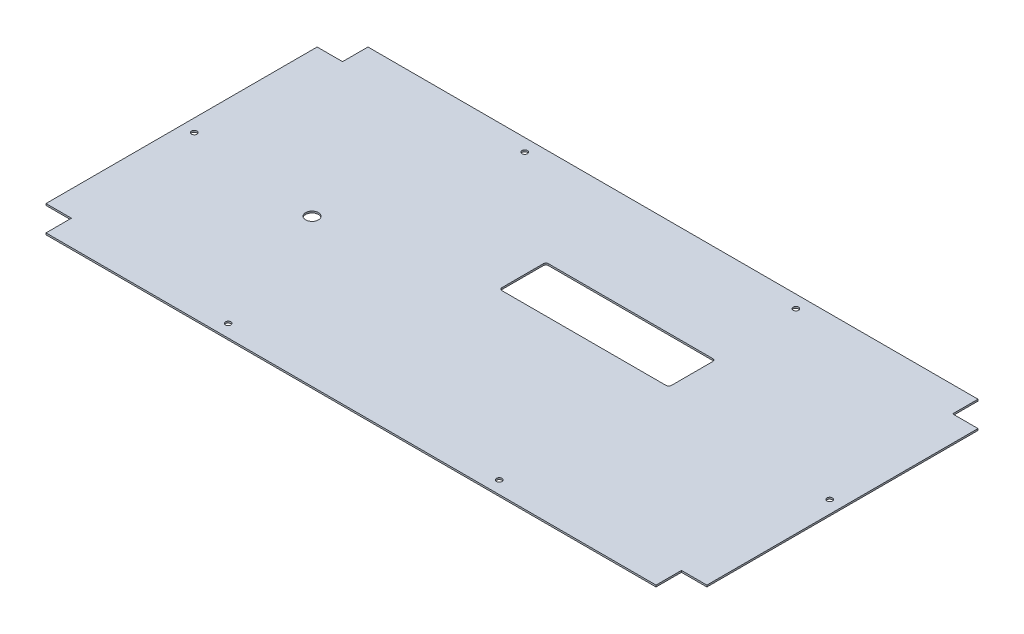
ISO-10303-21;
HEADER;
FILE_DESCRIPTION(('STEP AP214'),'2;1');
FILE_NAME('part.step','',(''),(''),'','','');
FILE_SCHEMA(('AUTOMOTIVE_DESIGN { 1 0 10303 214 1 1 1 1 }'));
ENDSEC;
DATA;
#1=APPLICATION_CONTEXT('core data for automotive mechanical design processes');
#2=APPLICATION_PROTOCOL_DEFINITION('international standard','automotive_design',2000,#1);
#3=PRODUCT_CONTEXT('',#1,'mechanical');
#4=PRODUCT('Part','Part','',(#3));
#5=PRODUCT_RELATED_PRODUCT_CATEGORY('part','',(#4));
#6=PRODUCT_DEFINITION_FORMATION('','',#4);
#7=PRODUCT_DEFINITION_CONTEXT('part definition',#1,'design');
#8=PRODUCT_DEFINITION('design','',#6,#7);
#9=PRODUCT_DEFINITION_SHAPE('','',#8);
#10=(LENGTH_UNIT() NAMED_UNIT(*) SI_UNIT(.MILLI.,.METRE.));
#11=(NAMED_UNIT(*) PLANE_ANGLE_UNIT() SI_UNIT($,.RADIAN.));
#12=(NAMED_UNIT(*) SI_UNIT($,.STERADIAN.) SOLID_ANGLE_UNIT());
#13=UNCERTAINTY_MEASURE_WITH_UNIT(LENGTH_MEASURE(1.E-05),#10,'distance_accuracy_value','');
#14=(GEOMETRIC_REPRESENTATION_CONTEXT(3) GLOBAL_UNCERTAINTY_ASSIGNED_CONTEXT((#13)) GLOBAL_UNIT_ASSIGNED_CONTEXT((#10,
#11,#12)) REPRESENTATION_CONTEXT('',''));
#15=CARTESIAN_POINT('',(0.,0.,0.));
#16=DIRECTION('',(0.,0.,1.));
#17=DIRECTION('',(1.,0.,0.));
#18=AXIS2_PLACEMENT_3D('',#15,#16,#17);
#19=CARTESIAN_POINT('',(390.,2.,-190.));
#20=DIRECTION('',(-1.,0.,0.));
#21=DIRECTION('',(0.,0.,1.));
#22=AXIS2_PLACEMENT_3D('',#19,#20,#21);
#23=PLANE('',#22);
#24=DIRECTION('',(0.,0.,-1.));
#25=VECTOR('',#24,1.);
#26=CARTESIAN_POINT('',(390.,2.,-190.));
#27=LINE('',#26,#25);
#28=CARTESIAN_POINT('',(390.,2.,160.));
#29=VERTEX_POINT('',#28);
#30=CARTESIAN_POINT('',(390.,2.,-160.));
#31=VERTEX_POINT('',#30);
#32=EDGE_CURVE('E433',#29,#31,#27,.T.);
#33=ORIENTED_EDGE('',*,*,#32,.F.);
#34=DIRECTION('',(0.,1.,0.));
#35=VECTOR('',#34,1.);
#36=CARTESIAN_POINT('',(390.,0.,160.));
#37=LINE('',#36,#35);
#38=CARTESIAN_POINT('',(390.,0.,160.));
#39=VERTEX_POINT('',#38);
#40=EDGE_CURVE('E360',#39,#29,#37,.T.);
#41=ORIENTED_EDGE('',*,*,#40,.F.);
#42=DIRECTION('',(0.,0.,-1.));
#43=VECTOR('',#42,1.);
#44=CARTESIAN_POINT('',(390.,0.,-190.));
#45=LINE('',#44,#43);
#46=CARTESIAN_POINT('',(390.,0.,-160.));
#47=VERTEX_POINT('',#46);
#48=EDGE_CURVE('E427',#39,#47,#45,.T.);
#49=ORIENTED_EDGE('',*,*,#48,.T.);
#50=DIRECTION('',(0.,1.,0.));
#51=VECTOR('',#50,1.);
#52=CARTESIAN_POINT('',(390.,0.,-160.));
#53=LINE('',#52,#51);
#54=EDGE_CURVE('E340',#47,#31,#53,.T.);
#55=ORIENTED_EDGE('',*,*,#54,.T.);
#56=EDGE_LOOP('',(#33,#41,#49,#55));
#57=FACE_BOUND('',#56,.T.);
#58=ADVANCED_FACE('F45',(#57),#23,.F.);
#59=CARTESIAN_POINT('',(-390.,2.,-190.));
#60=DIRECTION('',(0.,0.,1.));
#61=DIRECTION('',(1.,0.,0.));
#62=AXIS2_PLACEMENT_3D('',#59,#60,#61);
#63=PLANE('',#62);
#64=DIRECTION('',(-1.,0.,0.));
#65=VECTOR('',#64,1.);
#66=CARTESIAN_POINT('',(-390.,2.,-190.));
#67=LINE('',#66,#65);
#68=CARTESIAN_POINT('',(360.,2.,-190.));
#69=VERTEX_POINT('',#68);
#70=CARTESIAN_POINT('',(-360.,2.,-190.));
#71=VERTEX_POINT('',#70);
#72=EDGE_CURVE('E437',#69,#71,#67,.T.);
#73=ORIENTED_EDGE('',*,*,#72,.F.);
#74=DIRECTION('',(0.,1.,0.));
#75=VECTOR('',#74,1.);
#76=CARTESIAN_POINT('',(360.,0.,-190.));
#77=LINE('',#76,#75);
#78=CARTESIAN_POINT('',(360.,0.,-190.));
#79=VERTEX_POINT('',#78);
#80=EDGE_CURVE('E333',#79,#69,#77,.T.);
#81=ORIENTED_EDGE('',*,*,#80,.F.);
#82=DIRECTION('',(-1.,0.,0.));
#83=VECTOR('',#82,1.);
#84=CARTESIAN_POINT('',(-390.,0.,-190.));
#85=LINE('',#84,#83);
#86=CARTESIAN_POINT('',(-360.,0.,-190.));
#87=VERTEX_POINT('',#86);
#88=EDGE_CURVE('E447',#79,#87,#85,.T.);
#89=ORIENTED_EDGE('',*,*,#88,.T.);
#90=DIRECTION('',(0.,1.,0.));
#91=VECTOR('',#90,1.);
#92=CARTESIAN_POINT('',(-360.,0.,-190.));
#93=LINE('',#92,#91);
#94=EDGE_CURVE('E423',#87,#71,#93,.T.);
#95=ORIENTED_EDGE('',*,*,#94,.T.);
#96=EDGE_LOOP('',(#73,#81,#89,#95));
#97=FACE_BOUND('',#96,.T.);
#98=ADVANCED_FACE('F496',(#97),#63,.F.);
#99=CARTESIAN_POINT('',(-390.,2.,-190.));
#100=DIRECTION('',(1.,0.,0.));
#101=DIRECTION('',(0.,0.,-1.));
#102=AXIS2_PLACEMENT_3D('',#99,#100,#101);
#103=PLANE('',#102);
#104=DIRECTION('',(0.,0.,1.));
#105=VECTOR('',#104,1.);
#106=CARTESIAN_POINT('',(-390.,0.,-190.));
#107=LINE('',#106,#105);
#108=CARTESIAN_POINT('',(-390.,0.,-160.));
#109=VERTEX_POINT('',#108);
#110=CARTESIAN_POINT('',(-390.,0.,160.));
#111=VERTEX_POINT('',#110);
#112=EDGE_CURVE('E450',#109,#111,#107,.T.);
#113=ORIENTED_EDGE('',*,*,#112,.T.);
#114=DIRECTION('',(0.,1.,0.));
#115=VECTOR('',#114,1.);
#116=CARTESIAN_POINT('',(-390.,0.,160.));
#117=LINE('',#116,#115);
#118=CARTESIAN_POINT('',(-390.,2.,160.));
#119=VERTEX_POINT('',#118);
#120=EDGE_CURVE('E289',#111,#119,#117,.T.);
#121=ORIENTED_EDGE('',*,*,#120,.T.);
#122=DIRECTION('',(0.,0.,1.));
#123=VECTOR('',#122,1.);
#124=CARTESIAN_POINT('',(-390.,2.,-190.));
#125=LINE('',#124,#123);
#126=CARTESIAN_POINT('',(-390.,2.,-160.));
#127=VERTEX_POINT('',#126);
#128=EDGE_CURVE('E54',#127,#119,#125,.T.);
#129=ORIENTED_EDGE('',*,*,#128,.F.);
#130=DIRECTION('',(0.,1.,0.));
#131=VECTOR('',#130,1.);
#132=CARTESIAN_POINT('',(-390.,0.,-160.));
#133=LINE('',#132,#131);
#134=EDGE_CURVE('E417',#109,#127,#133,.T.);
#135=ORIENTED_EDGE('',*,*,#134,.F.);
#136=EDGE_LOOP('',(#113,#121,#129,#135));
#137=FACE_BOUND('',#136,.T.);
#138=ADVANCED_FACE('F489',(#137),#103,.F.);
#139=CARTESIAN_POINT('',(-390.,2.,190.));
#140=DIRECTION('',(0.,0.,-1.));
#141=DIRECTION('',(-1.,0.,0.));
#142=AXIS2_PLACEMENT_3D('',#139,#140,#141);
#143=PLANE('',#142);
#144=DIRECTION('',(1.,0.,0.));
#145=VECTOR('',#144,1.);
#146=CARTESIAN_POINT('',(-390.,2.,190.));
#147=LINE('',#146,#145);
#148=CARTESIAN_POINT('',(-360.,2.,190.));
#149=VERTEX_POINT('',#148);
#150=CARTESIAN_POINT('',(360.,2.,190.));
#151=VERTEX_POINT('',#150);
#152=EDGE_CURVE('E11',#149,#151,#147,.T.);
#153=ORIENTED_EDGE('',*,*,#152,.F.);
#154=DIRECTION('',(0.,1.,0.));
#155=VECTOR('',#154,1.);
#156=CARTESIAN_POINT('',(-360.,0.,190.));
#157=LINE('',#156,#155);
#158=CARTESIAN_POINT('',(-360.,0.,190.));
#159=VERTEX_POINT('',#158);
#160=EDGE_CURVE('E385',#159,#149,#157,.T.);
#161=ORIENTED_EDGE('',*,*,#160,.F.);
#162=DIRECTION('',(1.,0.,0.));
#163=VECTOR('',#162,1.);
#164=CARTESIAN_POINT('',(-390.,0.,190.));
#165=LINE('',#164,#163);
#166=CARTESIAN_POINT('',(360.,0.,190.));
#167=VERTEX_POINT('',#166);
#168=EDGE_CURVE('E48',#159,#167,#165,.T.);
#169=ORIENTED_EDGE('',*,*,#168,.T.);
#170=DIRECTION('',(0.,1.,0.));
#171=VECTOR('',#170,1.);
#172=CARTESIAN_POINT('',(360.,0.,190.));
#173=LINE('',#172,#171);
#174=EDGE_CURVE('E367',#167,#151,#173,.T.);
#175=ORIENTED_EDGE('',*,*,#174,.T.);
#176=EDGE_LOOP('',(#153,#161,#169,#175));
#177=FACE_BOUND('',#176,.T.);
#178=ADVANCED_FACE('F462',(#177),#143,.F.);
#179=CARTESIAN_POINT('',(0.,2.,0.));
#180=DIRECTION('',(0.,1.,0.));
#181=DIRECTION('',(0.,0.,1.));
#182=AXIS2_PLACEMENT_3D('',#179,#180,#181);
#183=PLANE('',#182);
#184=CARTESIAN_POINT('',(162.,2.,-72.0000000000001));
#185=DIRECTION('',(0.,1.,0.));
#186=DIRECTION('',(0.,0.,-1.));
#187=AXIS2_PLACEMENT_3D('',#184,#185,#186);
#188=CIRCLE('',#187,3.);
#189=CARTESIAN_POINT('',(165.,2.,-72.0000000000001));
#190=VERTEX_POINT('',#189);
#191=CARTESIAN_POINT('',(162.,2.,-75.0000000000001));
#192=VERTEX_POINT('',#191);
#193=EDGE_CURVE('E62',#190,#192,#188,.T.);
#194=ORIENTED_EDGE('',*,*,#193,.F.);
#195=DIRECTION('',(0.,0.,-1.));
#196=VECTOR('',#195,1.);
#197=CARTESIAN_POINT('',(165.,2.,-72.0000000000001));
#198=LINE('',#197,#196);
#199=CARTESIAN_POINT('',(165.,2.,-23.0000000000001));
#200=VERTEX_POINT('',#199);
#201=EDGE_CURVE('E206',#200,#190,#198,.T.);
#202=ORIENTED_EDGE('',*,*,#201,.F.);
#203=CARTESIAN_POINT('',(162.,2.,-23.0000000000001));
#204=DIRECTION('',(0.,1.,0.));
#205=DIRECTION('',(0.,0.,1.));
#206=AXIS2_PLACEMENT_3D('',#203,#204,#205);
#207=CIRCLE('',#206,3.);
#208=CARTESIAN_POINT('',(162.,2.,-20.0000000000001));
#209=VERTEX_POINT('',#208);
#210=EDGE_CURVE('E210',#209,#200,#207,.T.);
#211=ORIENTED_EDGE('',*,*,#210,.F.);
#212=DIRECTION('',(1.,0.,0.));
#213=VECTOR('',#212,1.);
#214=CARTESIAN_POINT('',(-32.0000000000001,2.,-20.0000000000001));
#215=LINE('',#214,#213);
#216=CARTESIAN_POINT('',(-32.0000000000001,2.,-20.0000000000001));
#217=VERTEX_POINT('',#216);
#218=EDGE_CURVE('E249',#217,#209,#215,.T.);
#219=ORIENTED_EDGE('',*,*,#218,.F.);
#220=CARTESIAN_POINT('',(-32.0000000000001,2.,-23.0000000000001));
#221=DIRECTION('',(0.,1.,0.));
#222=DIRECTION('',(0.,0.,1.));
#223=AXIS2_PLACEMENT_3D('',#220,#221,#222);
#224=CIRCLE('',#223,3.);
#225=CARTESIAN_POINT('',(-35.0000000000001,2.,-23.0000000000001));
#226=VERTEX_POINT('',#225);
#227=EDGE_CURVE('E245',#226,#217,#224,.T.);
#228=ORIENTED_EDGE('',*,*,#227,.F.);
#229=DIRECTION('',(0.,0.,1.));
#230=VECTOR('',#229,1.);
#231=CARTESIAN_POINT('',(-35.0000000000001,2.,-72.0000000000001));
#232=LINE('',#231,#230);
#233=CARTESIAN_POINT('',(-35.0000000000001,2.,-72.0000000000001));
#234=VERTEX_POINT('',#233);
#235=EDGE_CURVE('E241',#234,#226,#232,.T.);
#236=ORIENTED_EDGE('',*,*,#235,.F.);
#237=CARTESIAN_POINT('',(-32.0000000000001,2.,-72.0000000000001));
#238=DIRECTION('',(0.,1.,0.));
#239=DIRECTION('',(0.,0.,1.));
#240=AXIS2_PLACEMENT_3D('',#237,#238,#239);
#241=CIRCLE('',#240,3.);
#242=CARTESIAN_POINT('',(-32.0000000000001,2.,-75.0000000000001));
#243=VERTEX_POINT('',#242);
#244=EDGE_CURVE('E237',#243,#234,#241,.T.);
#245=ORIENTED_EDGE('',*,*,#244,.F.);
#246=DIRECTION('',(-1.,0.,0.));
#247=VECTOR('',#246,1.);
#248=CARTESIAN_POINT('',(-32.0000000000001,2.,-75.0000000000001));
#249=LINE('',#248,#247);
#250=EDGE_CURVE('E234',#192,#243,#249,.T.);
#251=ORIENTED_EDGE('',*,*,#250,.F.);
#252=EDGE_LOOP('',(#194,#202,#211,#219,#228,#236,#245,#251));
#253=FACE_BOUND('',#252,.T.);
#254=CARTESIAN_POINT('',(-220.,2.,15.9999999999999));
#255=DIRECTION('',(0.,1.,0.));
#256=DIRECTION('',(0.,0.,1.));
#257=AXIS2_PLACEMENT_3D('',#254,#255,#256);
#258=CIRCLE('',#257,7.50000000000001);
#259=CARTESIAN_POINT('',(-220.,2.,23.4999999999999));
#260=VERTEX_POINT('',#259);
#261=EDGE_CURVE('E259',#260,#260,#258,.T.);
#262=ORIENTED_EDGE('',*,*,#261,.F.);
#263=EDGE_LOOP('',(#262));
#264=FACE_BOUND('',#263,.T.);
#265=CARTESIAN_POINT('',(-375.,2.,0.));
#266=DIRECTION('',(0.,1.,0.));
#267=DIRECTION('',(0.,0.,1.));
#268=AXIS2_PLACEMENT_3D('',#265,#266,#267);
#269=CIRCLE('',#268,3.24999999999995);
#270=CARTESIAN_POINT('',(-375.,2.,3.2499999999999));
#271=VERTEX_POINT('',#270);
#272=EDGE_CURVE('E290',#271,#271,#269,.T.);
#273=ORIENTED_EDGE('',*,*,#272,.F.);
#274=EDGE_LOOP('',(#273));
#275=FACE_BOUND('',#274,.T.);
#276=CARTESIAN_POINT('',(160.,2.,175.));
#277=DIRECTION('',(0.,1.,0.));
#278=DIRECTION('',(0.,0.,1.));
#279=AXIS2_PLACEMENT_3D('',#276,#277,#278);
#280=CIRCLE('',#279,3.25000000000001);
#281=CARTESIAN_POINT('',(160.,2.,178.25));
#282=VERTEX_POINT('',#281);
#283=EDGE_CURVE('E295',#282,#282,#280,.T.);
#284=ORIENTED_EDGE('',*,*,#283,.F.);
#285=EDGE_LOOP('',(#284));
#286=FACE_BOUND('',#285,.T.);
#287=CARTESIAN_POINT('',(375.,2.,0.));
#288=DIRECTION('',(0.,1.,0.));
#289=DIRECTION('',(0.,0.,1.));
#290=AXIS2_PLACEMENT_3D('',#287,#288,#289);
#291=CIRCLE('',#290,3.24999999999995);
#292=CARTESIAN_POINT('',(375.,2.,3.2499999999999));
#293=VERTEX_POINT('',#292);
#294=EDGE_CURVE('E294',#293,#293,#291,.T.);
#295=ORIENTED_EDGE('',*,*,#294,.F.);
#296=EDGE_LOOP('',(#295));
#297=FACE_BOUND('',#296,.T.);
#298=CARTESIAN_POINT('',(-160.,2.,-175.));
#299=DIRECTION('',(0.,1.,0.));
#300=DIRECTION('',(0.,0.,1.));
#301=AXIS2_PLACEMENT_3D('',#298,#299,#300);
#302=CIRCLE('',#301,3.25000000000001);
#303=CARTESIAN_POINT('',(-160.,2.,-171.75));
#304=VERTEX_POINT('',#303);
#305=EDGE_CURVE('E326',#304,#304,#302,.T.);
#306=ORIENTED_EDGE('',*,*,#305,.F.);
#307=EDGE_LOOP('',(#306));
#308=FACE_BOUND('',#307,.T.);
#309=CARTESIAN_POINT('',(160.,2.,-175.));
#310=DIRECTION('',(0.,1.,0.));
#311=DIRECTION('',(0.,0.,1.));
#312=AXIS2_PLACEMENT_3D('',#309,#310,#311);
#313=CIRCLE('',#312,3.25000000000001);
#314=CARTESIAN_POINT('',(160.,2.,-171.75));
#315=VERTEX_POINT('',#314);
#316=EDGE_CURVE('E303',#315,#315,#313,.T.);
#317=ORIENTED_EDGE('',*,*,#316,.F.);
#318=EDGE_LOOP('',(#317));
#319=FACE_BOUND('',#318,.T.);
#320=CARTESIAN_POINT('',(-160.,2.,175.));
#321=DIRECTION('',(0.,1.,0.));
#322=DIRECTION('',(0.,0.,1.));
#323=AXIS2_PLACEMENT_3D('',#320,#321,#322);
#324=CIRCLE('',#323,3.25000000000001);
#325=CARTESIAN_POINT('',(-160.,2.,178.25));
#326=VERTEX_POINT('',#325);
#327=EDGE_CURVE('E312',#326,#326,#324,.T.);
#328=ORIENTED_EDGE('',*,*,#327,.F.);
#329=EDGE_LOOP('',(#328));
#330=FACE_BOUND('',#329,.T.);
#331=DIRECTION('',(-1.,0.,0.));
#332=VECTOR('',#331,1.);
#333=CARTESIAN_POINT('',(-390.,2.,160.));
#334=LINE('',#333,#332);
#335=CARTESIAN_POINT('',(-360.,2.,160.));
#336=VERTEX_POINT('',#335);
#337=EDGE_CURVE('E395',#336,#119,#334,.T.);
#338=ORIENTED_EDGE('',*,*,#337,.F.);
#339=DIRECTION('',(0.,0.,-1.));
#340=VECTOR('',#339,1.);
#341=CARTESIAN_POINT('',(-360.,2.,190.));
#342=LINE('',#341,#340);
#343=EDGE_CURVE('E371',#149,#336,#342,.T.);
#344=ORIENTED_EDGE('',*,*,#343,.F.);
#345=ORIENTED_EDGE('',*,*,#152,.T.);
#346=DIRECTION('',(0.,0.,1.));
#347=VECTOR('',#346,1.);
#348=CARTESIAN_POINT('',(360.,2.,190.));
#349=LINE('',#348,#347);
#350=CARTESIAN_POINT('',(360.,2.,160.));
#351=VERTEX_POINT('',#350);
#352=EDGE_CURVE('E372',#351,#151,#349,.T.);
#353=ORIENTED_EDGE('',*,*,#352,.F.);
#354=DIRECTION('',(-1.,0.,0.));
#355=VECTOR('',#354,1.);
#356=CARTESIAN_POINT('',(390.,2.,160.));
#357=LINE('',#356,#355);
#358=EDGE_CURVE('E344',#29,#351,#357,.T.);
#359=ORIENTED_EDGE('',*,*,#358,.F.);
#360=ORIENTED_EDGE('',*,*,#32,.T.);
#361=DIRECTION('',(1.,0.,0.));
#362=VECTOR('',#361,1.);
#363=CARTESIAN_POINT('',(390.,2.,-160.));
#364=LINE('',#363,#362);
#365=CARTESIAN_POINT('',(360.,2.,-160.));
#366=VERTEX_POINT('',#365);
#367=EDGE_CURVE('E345',#366,#31,#364,.T.);
#368=ORIENTED_EDGE('',*,*,#367,.F.);
#369=DIRECTION('',(0.,0.,1.));
#370=VECTOR('',#369,1.);
#371=CARTESIAN_POINT('',(360.,2.,-190.));
#372=LINE('',#371,#370);
#373=EDGE_CURVE('E348',#69,#366,#372,.T.);
#374=ORIENTED_EDGE('',*,*,#373,.F.);
#375=ORIENTED_EDGE('',*,*,#72,.T.);
#376=DIRECTION('',(0.,0.,-1.));
#377=VECTOR('',#376,1.);
#378=CARTESIAN_POINT('',(-360.,2.,-190.));
#379=LINE('',#378,#377);
#380=CARTESIAN_POINT('',(-360.,2.,-160.));
#381=VERTEX_POINT('',#380);
#382=EDGE_CURVE('E413',#381,#71,#379,.T.);
#383=ORIENTED_EDGE('',*,*,#382,.F.);
#384=DIRECTION('',(1.,0.,0.));
#385=VECTOR('',#384,1.);
#386=CARTESIAN_POINT('',(-390.,2.,-160.));
#387=LINE('',#386,#385);
#388=EDGE_CURVE('E353',#127,#381,#387,.T.);
#389=ORIENTED_EDGE('',*,*,#388,.F.);
#390=ORIENTED_EDGE('',*,*,#128,.T.);
#391=EDGE_LOOP('',(#338,#344,#345,#353,#359,#360,#368,#374,#375,#383,#389,#390));
#392=FACE_BOUND('',#391,.T.);
#393=ADVANCED_FACE('F476',(#253,#264,#275,#286,#297,#308,#319,#330,#392),#183,.T.);
#394=CARTESIAN_POINT('',(0.,0.,0.));
#395=DIRECTION('',(0.,1.,0.));
#396=DIRECTION('',(0.,0.,1.));
#397=AXIS2_PLACEMENT_3D('',#394,#395,#396);
#398=PLANE('',#397);
#399=DIRECTION('',(0.,0.,-1.));
#400=VECTOR('',#399,1.);
#401=CARTESIAN_POINT('',(165.,0.,-72.0000000000001));
#402=LINE('',#401,#400);
#403=CARTESIAN_POINT('',(165.,0.,-23.0000000000001));
#404=VERTEX_POINT('',#403);
#405=CARTESIAN_POINT('',(165.,0.,-72.0000000000001));
#406=VERTEX_POINT('',#405);
#407=EDGE_CURVE('E193',#404,#406,#402,.T.);
#408=ORIENTED_EDGE('',*,*,#407,.T.);
#409=CARTESIAN_POINT('',(162.,0.,-72.0000000000001));
#410=DIRECTION('',(0.,1.,0.));
#411=DIRECTION('',(0.,0.,-1.));
#412=AXIS2_PLACEMENT_3D('',#409,#410,#411);
#413=CIRCLE('',#412,3.);
#414=CARTESIAN_POINT('',(162.,0.,-75.0000000000001));
#415=VERTEX_POINT('',#414);
#416=EDGE_CURVE('E186',#406,#415,#413,.T.);
#417=ORIENTED_EDGE('',*,*,#416,.T.);
#418=DIRECTION('',(-1.,0.,0.));
#419=VECTOR('',#418,1.);
#420=CARTESIAN_POINT('',(-32.0000000000001,0.,-75.0000000000001));
#421=LINE('',#420,#419);
#422=CARTESIAN_POINT('',(-32.0000000000001,0.,-75.0000000000001));
#423=VERTEX_POINT('',#422);
#424=EDGE_CURVE('E196',#415,#423,#421,.T.);
#425=ORIENTED_EDGE('',*,*,#424,.T.);
#426=CARTESIAN_POINT('',(-32.0000000000001,0.,-72.0000000000001));
#427=DIRECTION('',(0.,1.,0.));
#428=DIRECTION('',(0.,0.,1.));
#429=AXIS2_PLACEMENT_3D('',#426,#427,#428);
#430=CIRCLE('',#429,3.);
#431=CARTESIAN_POINT('',(-35.0000000000001,0.,-72.0000000000001));
#432=VERTEX_POINT('',#431);
#433=EDGE_CURVE('E70',#423,#432,#430,.T.);
#434=ORIENTED_EDGE('',*,*,#433,.T.);
#435=DIRECTION('',(0.,0.,1.));
#436=VECTOR('',#435,1.);
#437=CARTESIAN_POINT('',(-35.0000000000001,0.,-72.0000000000001));
#438=LINE('',#437,#436);
#439=CARTESIAN_POINT('',(-35.0000000000001,0.,-23.0000000000001));
#440=VERTEX_POINT('',#439);
#441=EDGE_CURVE('E215',#432,#440,#438,.T.);
#442=ORIENTED_EDGE('',*,*,#441,.T.);
#443=CARTESIAN_POINT('',(-32.0000000000001,0.,-23.0000000000001));
#444=DIRECTION('',(0.,1.,0.));
#445=DIRECTION('',(0.,0.,1.));
#446=AXIS2_PLACEMENT_3D('',#443,#444,#445);
#447=CIRCLE('',#446,3.);
#448=CARTESIAN_POINT('',(-32.0000000000001,0.,-20.0000000000001));
#449=VERTEX_POINT('',#448);
#450=EDGE_CURVE('E219',#440,#449,#447,.T.);
#451=ORIENTED_EDGE('',*,*,#450,.T.);
#452=DIRECTION('',(1.,0.,0.));
#453=VECTOR('',#452,1.);
#454=CARTESIAN_POINT('',(-32.0000000000001,0.,-20.0000000000001));
#455=LINE('',#454,#453);
#456=CARTESIAN_POINT('',(162.,0.,-20.0000000000001));
#457=VERTEX_POINT('',#456);
#458=EDGE_CURVE('E223',#449,#457,#455,.T.);
#459=ORIENTED_EDGE('',*,*,#458,.T.);
#460=CARTESIAN_POINT('',(162.,0.,-23.0000000000001));
#461=DIRECTION('',(0.,1.,0.));
#462=DIRECTION('',(0.,0.,1.));
#463=AXIS2_PLACEMENT_3D('',#460,#461,#462);
#464=CIRCLE('',#463,3.);
#465=EDGE_CURVE('E227',#457,#404,#464,.T.);
#466=ORIENTED_EDGE('',*,*,#465,.T.);
#467=EDGE_LOOP('',(#408,#417,#425,#434,#442,#451,#459,#466));
#468=FACE_BOUND('',#467,.T.);
#469=CARTESIAN_POINT('',(-220.,0.,15.9999999999999));
#470=DIRECTION('',(0.,1.,0.));
#471=DIRECTION('',(0.,0.,1.));
#472=AXIS2_PLACEMENT_3D('',#469,#470,#471);
#473=CIRCLE('',#472,7.50000000000001);
#474=CARTESIAN_POINT('',(-220.,0.,23.4999999999999));
#475=VERTEX_POINT('',#474);
#476=EDGE_CURVE('E277',#475,#475,#473,.T.);
#477=ORIENTED_EDGE('',*,*,#476,.T.);
#478=EDGE_LOOP('',(#477));
#479=FACE_BOUND('',#478,.T.);
#480=CARTESIAN_POINT('',(-375.,0.,0.));
#481=DIRECTION('',(0.,1.,0.));
#482=DIRECTION('',(0.,0.,1.));
#483=AXIS2_PLACEMENT_3D('',#480,#481,#482);
#484=CIRCLE('',#483,3.24999999999995);
#485=CARTESIAN_POINT('',(-375.,0.,3.2499999999999));
#486=VERTEX_POINT('',#485);
#487=EDGE_CURVE('E285',#486,#486,#484,.T.);
#488=ORIENTED_EDGE('',*,*,#487,.T.);
#489=EDGE_LOOP('',(#488));
#490=FACE_BOUND('',#489,.T.);
#491=CARTESIAN_POINT('',(160.,0.,175.));
#492=DIRECTION('',(0.,1.,0.));
#493=DIRECTION('',(0.,0.,1.));
#494=AXIS2_PLACEMENT_3D('',#491,#492,#493);
#495=CIRCLE('',#494,3.25000000000001);
#496=CARTESIAN_POINT('',(160.,0.,178.25));
#497=VERTEX_POINT('',#496);
#498=EDGE_CURVE('E281',#497,#497,#495,.T.);
#499=ORIENTED_EDGE('',*,*,#498,.T.);
#500=EDGE_LOOP('',(#499));
#501=FACE_BOUND('',#500,.T.);
#502=CARTESIAN_POINT('',(375.,0.,0.));
#503=DIRECTION('',(0.,1.,0.));
#504=DIRECTION('',(0.,0.,1.));
#505=AXIS2_PLACEMENT_3D('',#502,#503,#504);
#506=CIRCLE('',#505,3.24999999999995);
#507=CARTESIAN_POINT('',(375.,0.,3.2499999999999));
#508=VERTEX_POINT('',#507);
#509=EDGE_CURVE('E322',#508,#508,#506,.T.);
#510=ORIENTED_EDGE('',*,*,#509,.T.);
#511=EDGE_LOOP('',(#510));
#512=FACE_BOUND('',#511,.T.);
#513=CARTESIAN_POINT('',(-160.,0.,-175.));
#514=DIRECTION('',(0.,1.,0.));
#515=DIRECTION('',(0.,0.,1.));
#516=AXIS2_PLACEMENT_3D('',#513,#514,#515);
#517=CIRCLE('',#516,3.25000000000001);
#518=CARTESIAN_POINT('',(-160.,0.,-171.75));
#519=VERTEX_POINT('',#518);
#520=EDGE_CURVE('E307',#519,#519,#517,.T.);
#521=ORIENTED_EDGE('',*,*,#520,.T.);
#522=EDGE_LOOP('',(#521));
#523=FACE_BOUND('',#522,.T.);
#524=CARTESIAN_POINT('',(160.,0.,-175.));
#525=DIRECTION('',(0.,1.,0.));
#526=DIRECTION('',(0.,0.,1.));
#527=AXIS2_PLACEMENT_3D('',#524,#525,#526);
#528=CIRCLE('',#527,3.25000000000001);
#529=CARTESIAN_POINT('',(160.,0.,-171.75));
#530=VERTEX_POINT('',#529);
#531=EDGE_CURVE('E308',#530,#530,#528,.T.);
#532=ORIENTED_EDGE('',*,*,#531,.T.);
#533=EDGE_LOOP('',(#532));
#534=FACE_BOUND('',#533,.T.);
#535=CARTESIAN_POINT('',(-160.,0.,175.));
#536=DIRECTION('',(0.,1.,0.));
#537=DIRECTION('',(0.,0.,1.));
#538=AXIS2_PLACEMENT_3D('',#535,#536,#537);
#539=CIRCLE('',#538,3.25000000000001);
#540=CARTESIAN_POINT('',(-160.,0.,178.25));
#541=VERTEX_POINT('',#540);
#542=EDGE_CURVE('E299',#541,#541,#539,.T.);
#543=ORIENTED_EDGE('',*,*,#542,.T.);
#544=EDGE_LOOP('',(#543));
#545=FACE_BOUND('',#544,.T.);
#546=DIRECTION('',(0.,0.,-1.));
#547=VECTOR('',#546,1.);
#548=CARTESIAN_POINT('',(-360.,0.,190.));
#549=LINE('',#548,#547);
#550=CARTESIAN_POINT('',(-360.,0.,160.));
#551=VERTEX_POINT('',#550);
#552=EDGE_CURVE('E398',#159,#551,#549,.T.);
#553=ORIENTED_EDGE('',*,*,#552,.T.);
#554=DIRECTION('',(-1.,0.,0.));
#555=VECTOR('',#554,1.);
#556=CARTESIAN_POINT('',(-390.,0.,160.));
#557=LINE('',#556,#555);
#558=EDGE_CURVE('E388',#551,#111,#557,.T.);
#559=ORIENTED_EDGE('',*,*,#558,.T.);
#560=ORIENTED_EDGE('',*,*,#112,.F.);
#561=DIRECTION('',(1.,0.,0.));
#562=VECTOR('',#561,1.);
#563=CARTESIAN_POINT('',(-390.,0.,-160.));
#564=LINE('',#563,#562);
#565=CARTESIAN_POINT('',(-360.,0.,-160.));
#566=VERTEX_POINT('',#565);
#567=EDGE_CURVE('E408',#109,#566,#564,.T.);
#568=ORIENTED_EDGE('',*,*,#567,.T.);
#569=DIRECTION('',(0.,0.,-1.));
#570=VECTOR('',#569,1.);
#571=CARTESIAN_POINT('',(-360.,0.,-190.));
#572=LINE('',#571,#570);
#573=EDGE_CURVE('E412',#566,#87,#572,.T.);
#574=ORIENTED_EDGE('',*,*,#573,.T.);
#575=ORIENTED_EDGE('',*,*,#88,.F.);
#576=DIRECTION('',(0.,0.,1.));
#577=VECTOR('',#576,1.);
#578=CARTESIAN_POINT('',(360.,0.,-190.));
#579=LINE('',#578,#577);
#580=CARTESIAN_POINT('',(360.,0.,-160.));
#581=VERTEX_POINT('',#580);
#582=EDGE_CURVE('E349',#79,#581,#579,.T.);
#583=ORIENTED_EDGE('',*,*,#582,.T.);
#584=DIRECTION('',(1.,0.,0.));
#585=VECTOR('',#584,1.);
#586=CARTESIAN_POINT('',(390.,0.,-160.));
#587=LINE('',#586,#585);
#588=EDGE_CURVE('E336',#581,#47,#587,.T.);
#589=ORIENTED_EDGE('',*,*,#588,.T.);
#590=ORIENTED_EDGE('',*,*,#48,.F.);
#591=DIRECTION('',(-1.,0.,0.));
#592=VECTOR('',#591,1.);
#593=CARTESIAN_POINT('',(390.,0.,160.));
#594=LINE('',#593,#592);
#595=CARTESIAN_POINT('',(360.,0.,160.));
#596=VERTEX_POINT('',#595);
#597=EDGE_CURVE('E375',#39,#596,#594,.T.);
#598=ORIENTED_EDGE('',*,*,#597,.T.);
#599=DIRECTION('',(0.,0.,1.));
#600=VECTOR('',#599,1.);
#601=CARTESIAN_POINT('',(360.,0.,190.));
#602=LINE('',#601,#600);
#603=EDGE_CURVE('E363',#596,#167,#602,.T.);
#604=ORIENTED_EDGE('',*,*,#603,.T.);
#605=ORIENTED_EDGE('',*,*,#168,.F.);
#606=EDGE_LOOP('',(#553,#559,#560,#568,#574,#575,#583,#589,#590,#598,#604,#605));
#607=FACE_BOUND('',#606,.T.);
#608=ADVANCED_FACE('F201',(#468,#479,#490,#501,#512,#523,#534,#545,#607),#398,.F.);
#609=CARTESIAN_POINT('',(-360.,0.,-190.));
#610=DIRECTION('',(1.,0.,0.));
#611=DIRECTION('',(0.,0.,-1.));
#612=AXIS2_PLACEMENT_3D('',#609,#610,#611);
#613=PLANE('',#612);
#614=ORIENTED_EDGE('',*,*,#382,.T.);
#615=ORIENTED_EDGE('',*,*,#94,.F.);
#616=ORIENTED_EDGE('',*,*,#573,.F.);
#617=DIRECTION('',(0.,1.,0.));
#618=VECTOR('',#617,1.);
#619=CARTESIAN_POINT('',(-360.,0.,-160.));
#620=LINE('',#619,#618);
#621=EDGE_CURVE('E428',#566,#381,#620,.T.);
#622=ORIENTED_EDGE('',*,*,#621,.T.);
#623=EDGE_LOOP('',(#614,#615,#616,#622));
#624=FACE_BOUND('',#623,.T.);
#625=ADVANCED_FACE('F494',(#624),#613,.F.);
#626=CARTESIAN_POINT('',(-390.,0.,-160.));
#627=DIRECTION('',(0.,0.,1.));
#628=DIRECTION('',(1.,0.,0.));
#629=AXIS2_PLACEMENT_3D('',#626,#627,#628);
#630=PLANE('',#629);
#631=ORIENTED_EDGE('',*,*,#388,.T.);
#632=ORIENTED_EDGE('',*,*,#621,.F.);
#633=ORIENTED_EDGE('',*,*,#567,.F.);
#634=ORIENTED_EDGE('',*,*,#134,.T.);
#635=EDGE_LOOP('',(#631,#632,#633,#634));
#636=FACE_BOUND('',#635,.T.);
#637=ADVANCED_FACE('F486',(#636),#630,.F.);
#638=CARTESIAN_POINT('',(390.,0.,-160.));
#639=DIRECTION('',(0.,0.,1.));
#640=DIRECTION('',(1.,0.,0.));
#641=AXIS2_PLACEMENT_3D('',#638,#639,#640);
#642=PLANE('',#641);
#643=ORIENTED_EDGE('',*,*,#367,.T.);
#644=ORIENTED_EDGE('',*,*,#54,.F.);
#645=ORIENTED_EDGE('',*,*,#588,.F.);
#646=DIRECTION('',(0.,1.,0.));
#647=VECTOR('',#646,1.);
#648=CARTESIAN_POINT('',(360.,0.,-160.));
#649=LINE('',#648,#647);
#650=EDGE_CURVE('E337',#581,#366,#649,.T.);
#651=ORIENTED_EDGE('',*,*,#650,.T.);
#652=EDGE_LOOP('',(#643,#644,#645,#651));
#653=FACE_BOUND('',#652,.T.);
#654=ADVANCED_FACE('F503',(#653),#642,.F.);
#655=CARTESIAN_POINT('',(360.,0.,-190.));
#656=DIRECTION('',(-1.,0.,0.));
#657=DIRECTION('',(0.,0.,1.));
#658=AXIS2_PLACEMENT_3D('',#655,#656,#657);
#659=PLANE('',#658);
#660=ORIENTED_EDGE('',*,*,#373,.T.);
#661=ORIENTED_EDGE('',*,*,#650,.F.);
#662=ORIENTED_EDGE('',*,*,#582,.F.);
#663=ORIENTED_EDGE('',*,*,#80,.T.);
#664=EDGE_LOOP('',(#660,#661,#662,#663));
#665=FACE_BOUND('',#664,.T.);
#666=ADVANCED_FACE('F500',(#665),#659,.F.);
#667=CARTESIAN_POINT('',(360.,0.,190.));
#668=DIRECTION('',(-1.,0.,0.));
#669=DIRECTION('',(0.,0.,1.));
#670=AXIS2_PLACEMENT_3D('',#667,#668,#669);
#671=PLANE('',#670);
#672=ORIENTED_EDGE('',*,*,#352,.T.);
#673=ORIENTED_EDGE('',*,*,#174,.F.);
#674=ORIENTED_EDGE('',*,*,#603,.F.);
#675=DIRECTION('',(0.,1.,0.));
#676=VECTOR('',#675,1.);
#677=CARTESIAN_POINT('',(360.,0.,160.));
#678=LINE('',#677,#676);
#679=EDGE_CURVE('E364',#596,#351,#678,.T.);
#680=ORIENTED_EDGE('',*,*,#679,.T.);
#681=EDGE_LOOP('',(#672,#673,#674,#680));
#682=FACE_BOUND('',#681,.T.);
#683=ADVANCED_FACE('F467',(#682),#671,.F.);
#684=CARTESIAN_POINT('',(390.,0.,160.));
#685=DIRECTION('',(0.,0.,-1.));
#686=DIRECTION('',(-1.,0.,0.));
#687=AXIS2_PLACEMENT_3D('',#684,#685,#686);
#688=PLANE('',#687);
#689=ORIENTED_EDGE('',*,*,#358,.T.);
#690=ORIENTED_EDGE('',*,*,#679,.F.);
#691=ORIENTED_EDGE('',*,*,#597,.F.);
#692=ORIENTED_EDGE('',*,*,#40,.T.);
#693=EDGE_LOOP('',(#689,#690,#691,#692));
#694=FACE_BOUND('',#693,.T.);
#695=ADVANCED_FACE('F469',(#694),#688,.F.);
#696=CARTESIAN_POINT('',(-390.,0.,160.));
#697=DIRECTION('',(0.,0.,-1.));
#698=DIRECTION('',(-1.,0.,0.));
#699=AXIS2_PLACEMENT_3D('',#696,#697,#698);
#700=PLANE('',#699);
#701=ORIENTED_EDGE('',*,*,#337,.T.);
#702=ORIENTED_EDGE('',*,*,#120,.F.);
#703=ORIENTED_EDGE('',*,*,#558,.F.);
#704=DIRECTION('',(0.,1.,0.));
#705=VECTOR('',#704,1.);
#706=CARTESIAN_POINT('',(-360.,0.,160.));
#707=LINE('',#706,#705);
#708=EDGE_CURVE('E389',#551,#336,#707,.T.);
#709=ORIENTED_EDGE('',*,*,#708,.T.);
#710=EDGE_LOOP('',(#701,#702,#703,#709));
#711=FACE_BOUND('',#710,.T.);
#712=ADVANCED_FACE('F482',(#711),#700,.F.);
#713=CARTESIAN_POINT('',(-360.,0.,190.));
#714=DIRECTION('',(1.,0.,0.));
#715=DIRECTION('',(0.,0.,-1.));
#716=AXIS2_PLACEMENT_3D('',#713,#714,#715);
#717=PLANE('',#716);
#718=ORIENTED_EDGE('',*,*,#343,.T.);
#719=ORIENTED_EDGE('',*,*,#708,.F.);
#720=ORIENTED_EDGE('',*,*,#552,.F.);
#721=ORIENTED_EDGE('',*,*,#160,.T.);
#722=EDGE_LOOP('',(#718,#719,#720,#721));
#723=FACE_BOUND('',#722,.T.);
#724=ADVANCED_FACE('F480',(#723),#717,.F.);
#725=CARTESIAN_POINT('',(-160.,0.,175.));
#726=DIRECTION('',(0.,1.,0.));
#727=DIRECTION('',(0.,0.,1.));
#728=AXIS2_PLACEMENT_3D('',#725,#726,#727);
#729=CYLINDRICAL_SURFACE('',#728,3.25000000000001);
#730=ORIENTED_EDGE('',*,*,#542,.F.);
#731=EDGE_LOOP('',(#730));
#732=FACE_BOUND('',#731,.T.);
#733=ORIENTED_EDGE('',*,*,#327,.T.);
#734=EDGE_LOOP('',(#733));
#735=FACE_BOUND('',#734,.T.);
#736=ADVANCED_FACE('F529',(#732,#735),#729,.F.);
#737=CARTESIAN_POINT('',(160.,0.,-175.));
#738=DIRECTION('',(0.,1.,0.));
#739=DIRECTION('',(0.,0.,1.));
#740=AXIS2_PLACEMENT_3D('',#737,#738,#739);
#741=CYLINDRICAL_SURFACE('',#740,3.25000000000001);
#742=ORIENTED_EDGE('',*,*,#531,.F.);
#743=EDGE_LOOP('',(#742));
#744=FACE_BOUND('',#743,.T.);
#745=ORIENTED_EDGE('',*,*,#316,.T.);
#746=EDGE_LOOP('',(#745));
#747=FACE_BOUND('',#746,.T.);
#748=ADVANCED_FACE('F542',(#744,#747),#741,.F.);
#749=CARTESIAN_POINT('',(-160.,0.,-175.));
#750=DIRECTION('',(0.,1.,0.));
#751=DIRECTION('',(0.,0.,1.));
#752=AXIS2_PLACEMENT_3D('',#749,#750,#751);
#753=CYLINDRICAL_SURFACE('',#752,3.25000000000001);
#754=ORIENTED_EDGE('',*,*,#520,.F.);
#755=EDGE_LOOP('',(#754));
#756=FACE_BOUND('',#755,.T.);
#757=ORIENTED_EDGE('',*,*,#305,.T.);
#758=EDGE_LOOP('',(#757));
#759=FACE_BOUND('',#758,.T.);
#760=ADVANCED_FACE('F538',(#756,#759),#753,.F.);
#761=CARTESIAN_POINT('',(375.,0.,0.));
#762=DIRECTION('',(0.,1.,0.));
#763=DIRECTION('',(0.,0.,1.));
#764=AXIS2_PLACEMENT_3D('',#761,#762,#763);
#765=CYLINDRICAL_SURFACE('',#764,3.24999999999995);
#766=ORIENTED_EDGE('',*,*,#509,.F.);
#767=EDGE_LOOP('',(#766));
#768=FACE_BOUND('',#767,.T.);
#769=ORIENTED_EDGE('',*,*,#294,.T.);
#770=EDGE_LOOP('',(#769));
#771=FACE_BOUND('',#770,.T.);
#772=ADVANCED_FACE('F541',(#768,#771),#765,.F.);
#773=CARTESIAN_POINT('',(160.,0.,175.));
#774=DIRECTION('',(0.,1.,0.));
#775=DIRECTION('',(0.,0.,1.));
#776=AXIS2_PLACEMENT_3D('',#773,#774,#775);
#777=CYLINDRICAL_SURFACE('',#776,3.25000000000001);
#778=ORIENTED_EDGE('',*,*,#498,.F.);
#779=EDGE_LOOP('',(#778));
#780=FACE_BOUND('',#779,.T.);
#781=ORIENTED_EDGE('',*,*,#283,.T.);
#782=EDGE_LOOP('',(#781));
#783=FACE_BOUND('',#782,.T.);
#784=ADVANCED_FACE('F546',(#780,#783),#777,.F.);
#785=CARTESIAN_POINT('',(-375.,0.,0.));
#786=DIRECTION('',(0.,1.,0.));
#787=DIRECTION('',(0.,0.,1.));
#788=AXIS2_PLACEMENT_3D('',#785,#786,#787);
#789=CYLINDRICAL_SURFACE('',#788,3.24999999999995);
#790=ORIENTED_EDGE('',*,*,#487,.F.);
#791=EDGE_LOOP('',(#790));
#792=FACE_BOUND('',#791,.T.);
#793=ORIENTED_EDGE('',*,*,#272,.T.);
#794=EDGE_LOOP('',(#793));
#795=FACE_BOUND('',#794,.T.);
#796=ADVANCED_FACE('F556',(#792,#795),#789,.F.);
#797=CARTESIAN_POINT('',(-220.,0.,15.9999999999999));
#798=DIRECTION('',(0.,1.,0.));
#799=DIRECTION('',(0.,0.,1.));
#800=AXIS2_PLACEMENT_3D('',#797,#798,#799);
#801=CYLINDRICAL_SURFACE('',#800,7.50000000000001);
#802=ORIENTED_EDGE('',*,*,#476,.F.);
#803=EDGE_LOOP('',(#802));
#804=FACE_BOUND('',#803,.T.);
#805=ORIENTED_EDGE('',*,*,#261,.T.);
#806=EDGE_LOOP('',(#805));
#807=FACE_BOUND('',#806,.T.);
#808=ADVANCED_FACE('F560',(#804,#807),#801,.F.);
#809=CARTESIAN_POINT('',(162.,0.,-72.0000000000001));
#810=DIRECTION('',(0.,1.,0.));
#811=DIRECTION('',(0.,0.,1.));
#812=AXIS2_PLACEMENT_3D('',#809,#810,#811);
#813=CYLINDRICAL_SURFACE('',#812,3.);
#814=ORIENTED_EDGE('',*,*,#193,.T.);
#815=DIRECTION('',(0.,1.,0.));
#816=VECTOR('',#815,1.);
#817=CARTESIAN_POINT('',(162.,0.,-75.0000000000001));
#818=LINE('',#817,#816);
#819=EDGE_CURVE('E182',#415,#192,#818,.T.);
#820=ORIENTED_EDGE('',*,*,#819,.F.);
#821=ORIENTED_EDGE('',*,*,#416,.F.);
#822=DIRECTION('',(0.,1.,0.));
#823=VECTOR('',#822,1.);
#824=CARTESIAN_POINT('',(165.,0.,-72.0000000000001));
#825=LINE('',#824,#823);
#826=EDGE_CURVE('E256',#406,#190,#825,.T.);
#827=ORIENTED_EDGE('',*,*,#826,.T.);
#828=EDGE_LOOP('',(#814,#820,#821,#827));
#829=FACE_BOUND('',#828,.T.);
#830=ADVANCED_FACE('F184',(#829),#813,.F.);
#831=CARTESIAN_POINT('',(165.,0.,-72.0000000000001));
#832=DIRECTION('',(1.,0.,0.));
#833=DIRECTION('',(0.,0.,-1.));
#834=AXIS2_PLACEMENT_3D('',#831,#832,#833);
#835=PLANE('',#834);
#836=ORIENTED_EDGE('',*,*,#201,.T.);
#837=ORIENTED_EDGE('',*,*,#826,.F.);
#838=ORIENTED_EDGE('',*,*,#407,.F.);
#839=DIRECTION('',(0.,1.,0.));
#840=VECTOR('',#839,1.);
#841=CARTESIAN_POINT('',(165.,0.,-23.0000000000001));
#842=LINE('',#841,#840);
#843=EDGE_CURVE('E260',#404,#200,#842,.T.);
#844=ORIENTED_EDGE('',*,*,#843,.T.);
#845=EDGE_LOOP('',(#836,#837,#838,#844));
#846=FACE_BOUND('',#845,.T.);
#847=ADVANCED_FACE('F567',(#846),#835,.F.);
#848=CARTESIAN_POINT('',(162.,0.,-23.0000000000001));
#849=DIRECTION('',(0.,1.,0.));
#850=DIRECTION('',(0.,0.,1.));
#851=AXIS2_PLACEMENT_3D('',#848,#849,#850);
#852=CYLINDRICAL_SURFACE('',#851,3.);
#853=ORIENTED_EDGE('',*,*,#210,.T.);
#854=ORIENTED_EDGE('',*,*,#843,.F.);
#855=ORIENTED_EDGE('',*,*,#465,.F.);
#856=DIRECTION('',(0.,1.,0.));
#857=VECTOR('',#856,1.);
#858=CARTESIAN_POINT('',(162.,0.,-20.0000000000001));
#859=LINE('',#858,#857);
#860=EDGE_CURVE('E263',#457,#209,#859,.T.);
#861=ORIENTED_EDGE('',*,*,#860,.T.);
#862=EDGE_LOOP('',(#853,#854,#855,#861));
#863=FACE_BOUND('',#862,.T.);
#864=ADVANCED_FACE('F584',(#863),#852,.F.);
#865=CARTESIAN_POINT('',(-32.0000000000001,0.,-20.0000000000001));
#866=DIRECTION('',(0.,0.,1.));
#867=DIRECTION('',(1.,0.,0.));
#868=AXIS2_PLACEMENT_3D('',#865,#866,#867);
#869=PLANE('',#868);
#870=ORIENTED_EDGE('',*,*,#218,.T.);
#871=ORIENTED_EDGE('',*,*,#860,.F.);
#872=ORIENTED_EDGE('',*,*,#458,.F.);
#873=DIRECTION('',(0.,1.,0.));
#874=VECTOR('',#873,1.);
#875=CARTESIAN_POINT('',(-32.0000000000001,0.,-20.0000000000001));
#876=LINE('',#875,#874);
#877=EDGE_CURVE('E266',#449,#217,#876,.T.);
#878=ORIENTED_EDGE('',*,*,#877,.T.);
#879=EDGE_LOOP('',(#870,#871,#872,#878));
#880=FACE_BOUND('',#879,.T.);
#881=ADVANCED_FACE('F580',(#880),#869,.F.);
#882=CARTESIAN_POINT('',(-32.0000000000001,0.,-23.0000000000001));
#883=DIRECTION('',(0.,1.,0.));
#884=DIRECTION('',(0.,0.,1.));
#885=AXIS2_PLACEMENT_3D('',#882,#883,#884);
#886=CYLINDRICAL_SURFACE('',#885,3.);
#887=ORIENTED_EDGE('',*,*,#227,.T.);
#888=ORIENTED_EDGE('',*,*,#877,.F.);
#889=ORIENTED_EDGE('',*,*,#450,.F.);
#890=DIRECTION('',(0.,1.,0.));
#891=VECTOR('',#890,1.);
#892=CARTESIAN_POINT('',(-35.0000000000001,0.,-23.0000000000001));
#893=LINE('',#892,#891);
#894=EDGE_CURVE('E269',#440,#226,#893,.T.);
#895=ORIENTED_EDGE('',*,*,#894,.T.);
#896=EDGE_LOOP('',(#887,#888,#889,#895));
#897=FACE_BOUND('',#896,.T.);
#898=ADVANCED_FACE('F576',(#897),#886,.F.);
#899=CARTESIAN_POINT('',(-35.0000000000001,0.,-72.0000000000001));
#900=DIRECTION('',(-1.,0.,0.));
#901=DIRECTION('',(0.,0.,1.));
#902=AXIS2_PLACEMENT_3D('',#899,#900,#901);
#903=PLANE('',#902);
#904=ORIENTED_EDGE('',*,*,#235,.T.);
#905=ORIENTED_EDGE('',*,*,#894,.F.);
#906=ORIENTED_EDGE('',*,*,#441,.F.);
#907=DIRECTION('',(0.,1.,0.));
#908=VECTOR('',#907,1.);
#909=CARTESIAN_POINT('',(-35.0000000000001,0.,-72.0000000000001));
#910=LINE('',#909,#908);
#911=EDGE_CURVE('E272',#432,#234,#910,.T.);
#912=ORIENTED_EDGE('',*,*,#911,.T.);
#913=EDGE_LOOP('',(#904,#905,#906,#912));
#914=FACE_BOUND('',#913,.T.);
#915=ADVANCED_FACE('F573',(#914),#903,.F.);
#916=CARTESIAN_POINT('',(-32.0000000000001,0.,-72.0000000000001));
#917=DIRECTION('',(0.,1.,0.));
#918=DIRECTION('',(0.,0.,1.));
#919=AXIS2_PLACEMENT_3D('',#916,#917,#918);
#920=CYLINDRICAL_SURFACE('',#919,3.);
#921=ORIENTED_EDGE('',*,*,#244,.T.);
#922=ORIENTED_EDGE('',*,*,#911,.F.);
#923=ORIENTED_EDGE('',*,*,#433,.F.);
#924=DIRECTION('',(0.,1.,0.));
#925=VECTOR('',#924,1.);
#926=CARTESIAN_POINT('',(-32.0000000000001,0.,-75.0000000000001));
#927=LINE('',#926,#925);
#928=EDGE_CURVE('E192',#423,#243,#927,.T.);
#929=ORIENTED_EDGE('',*,*,#928,.T.);
#930=EDGE_LOOP('',(#921,#922,#923,#929));
#931=FACE_BOUND('',#930,.T.);
#932=ADVANCED_FACE('F570',(#931),#920,.F.);
#933=CARTESIAN_POINT('',(-32.0000000000001,0.,-75.0000000000001));
#934=DIRECTION('',(0.,0.,-1.));
#935=DIRECTION('',(-1.,0.,0.));
#936=AXIS2_PLACEMENT_3D('',#933,#934,#935);
#937=PLANE('',#936);
#938=ORIENTED_EDGE('',*,*,#250,.T.);
#939=ORIENTED_EDGE('',*,*,#928,.F.);
#940=ORIENTED_EDGE('',*,*,#424,.F.);
#941=ORIENTED_EDGE('',*,*,#819,.T.);
#942=EDGE_LOOP('',(#938,#939,#940,#941));
#943=FACE_BOUND('',#942,.T.);
#944=ADVANCED_FACE('F197',(#943),#937,.F.);
#945=CLOSED_SHELL('',(#58,#98,#138,#178,#393,#608,#625,#637,#654,#666,#683,#695,#712,#724,#736,
#748,#760,#772,#784,#796,#808,#830,#847,#864,#881,#898,#915,#932,#944));
#946=MANIFOLD_SOLID_BREP('B2',#945);
#947=ADVANCED_BREP_SHAPE_REPRESENTATION('',(#18,#946),#14);
#948=SHAPE_DEFINITION_REPRESENTATION(#9,#947);
ENDSEC;
END-ISO-10303-21;
